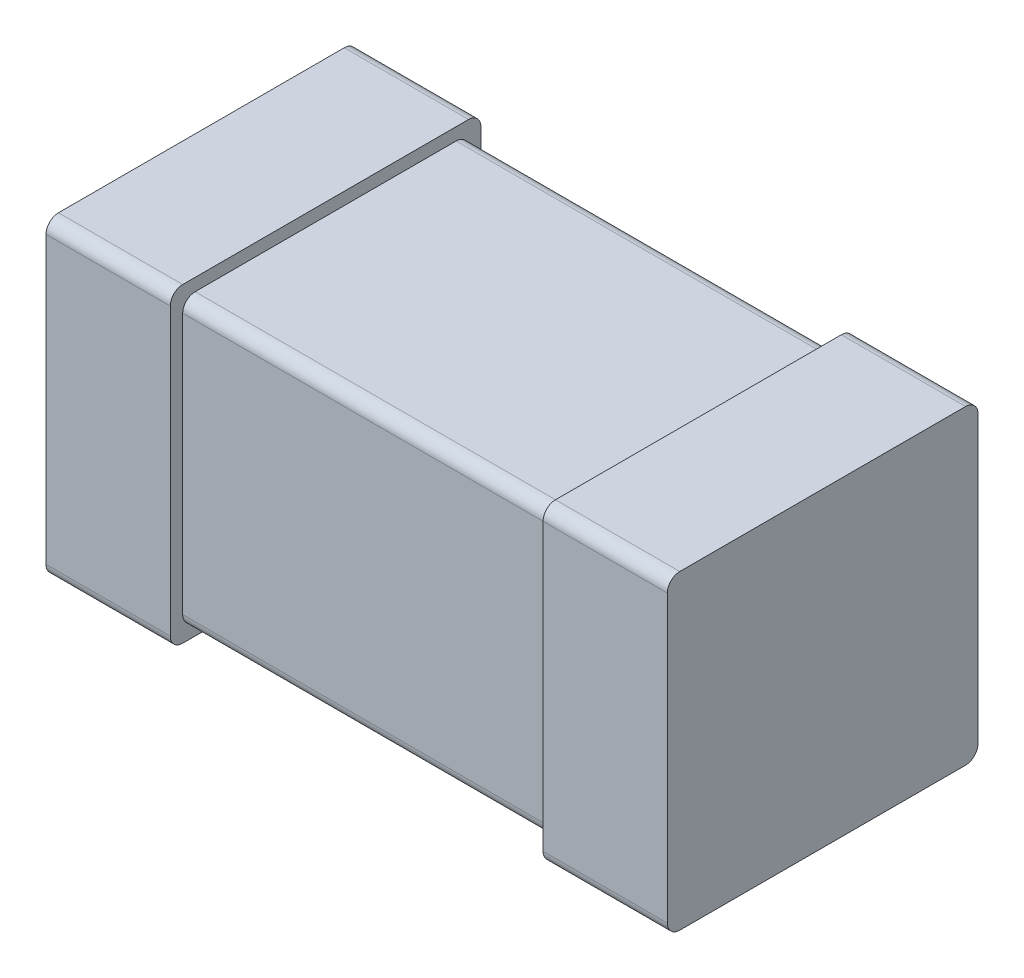
ISO-10303-21;
HEADER;
FILE_DESCRIPTION(('STEP AP214'),'2;1');
FILE_NAME('part.step','',(''),(''),'','','');
FILE_SCHEMA(('AUTOMOTIVE_DESIGN { 1 0 10303 214 1 1 1 1 }'));
ENDSEC;
DATA;
#1=APPLICATION_CONTEXT('core data for automotive mechanical design processes');
#2=APPLICATION_PROTOCOL_DEFINITION('international standard','automotive_design',2000,#1);
#3=PRODUCT_CONTEXT('',#1,'mechanical');
#4=PRODUCT('Part','Part','',(#3));
#5=PRODUCT_RELATED_PRODUCT_CATEGORY('part','',(#4));
#6=PRODUCT_DEFINITION_FORMATION('','',#4);
#7=PRODUCT_DEFINITION_CONTEXT('part definition',#1,'design');
#8=PRODUCT_DEFINITION('design','',#6,#7);
#9=PRODUCT_DEFINITION_SHAPE('','',#8);
#10=(LENGTH_UNIT() NAMED_UNIT(*) SI_UNIT(.MILLI.,.METRE.));
#11=(NAMED_UNIT(*) PLANE_ANGLE_UNIT() SI_UNIT($,.RADIAN.));
#12=(NAMED_UNIT(*) SI_UNIT($,.STERADIAN.) SOLID_ANGLE_UNIT());
#13=UNCERTAINTY_MEASURE_WITH_UNIT(LENGTH_MEASURE(1.E-05),#10,'distance_accuracy_value','');
#14=(GEOMETRIC_REPRESENTATION_CONTEXT(3) GLOBAL_UNCERTAINTY_ASSIGNED_CONTEXT((#13)) GLOBAL_UNIT_ASSIGNED_CONTEXT((#10,
#11,#12)) REPRESENTATION_CONTEXT('',''));
#15=CARTESIAN_POINT('',(0.,0.,0.));
#16=DIRECTION('',(0.,0.,1.));
#17=DIRECTION('',(1.,0.,0.));
#18=AXIS2_PLACEMENT_3D('',#15,#16,#17);
#19=CARTESIAN_POINT('',(0.5,-0.25,0.));
#20=DIRECTION('',(1.,0.,0.));
#21=DIRECTION('',(0.,1.,0.));
#22=AXIS2_PLACEMENT_3D('',#19,#20,#21);
#23=PLANE('',#22);
#24=DIRECTION('',(0.,0.,1.));
#25=VECTOR('',#24,1.);
#26=CARTESIAN_POINT('',(0.5,-0.25,0.));
#27=LINE('',#26,#25);
#28=CARTESIAN_POINT('',(0.5,-0.25,0.02));
#29=VERTEX_POINT('',#28);
#30=CARTESIAN_POINT('',(0.5,-0.25,0.48));
#31=VERTEX_POINT('',#30);
#32=EDGE_CURVE('E269',#29,#31,#27,.T.);
#33=ORIENTED_EDGE('',*,*,#32,.F.);
#34=CARTESIAN_POINT('',(0.5,-0.23,0.02));
#35=DIRECTION('',(1.,0.,0.));
#36=DIRECTION('',(0.,0.,1.));
#37=AXIS2_PLACEMENT_3D('',#34,#35,#36);
#38=CIRCLE('',#37,0.02);
#39=CARTESIAN_POINT('',(0.5,-0.23,0.));
#40=VERTEX_POINT('',#39);
#41=EDGE_CURVE('E346',#29,#40,#38,.T.);
#42=ORIENTED_EDGE('',*,*,#41,.T.);
#43=DIRECTION('',(0.,1.,0.));
#44=VECTOR('',#43,1.);
#45=CARTESIAN_POINT('',(0.5,-0.25,0.));
#46=LINE('',#45,#44);
#47=CARTESIAN_POINT('',(0.5,0.23,0.));
#48=VERTEX_POINT('',#47);
#49=EDGE_CURVE('E263',#40,#48,#46,.T.);
#50=ORIENTED_EDGE('',*,*,#49,.T.);
#51=CARTESIAN_POINT('',(0.5,0.23,0.02));
#52=DIRECTION('',(-1.,0.,0.));
#53=DIRECTION('',(0.,0.,1.));
#54=AXIS2_PLACEMENT_3D('',#51,#52,#53);
#55=CIRCLE('',#54,0.02);
#56=CARTESIAN_POINT('',(0.5,0.25,0.02));
#57=VERTEX_POINT('',#56);
#58=EDGE_CURVE('E295',#57,#48,#55,.T.);
#59=ORIENTED_EDGE('',*,*,#58,.F.);
#60=DIRECTION('',(0.,0.,1.));
#61=VECTOR('',#60,1.);
#62=CARTESIAN_POINT('',(0.5,0.25,0.));
#63=LINE('',#62,#61);
#64=CARTESIAN_POINT('',(0.5,0.25,0.48));
#65=VERTEX_POINT('',#64);
#66=EDGE_CURVE('E11',#57,#65,#63,.T.);
#67=ORIENTED_EDGE('',*,*,#66,.T.);
#68=CARTESIAN_POINT('',(0.5,0.23,0.48));
#69=DIRECTION('',(1.,0.,0.));
#70=DIRECTION('',(0.,0.,1.));
#71=AXIS2_PLACEMENT_3D('',#68,#69,#70);
#72=CIRCLE('',#71,0.02);
#73=CARTESIAN_POINT('',(0.5,0.23,0.5));
#74=VERTEX_POINT('',#73);
#75=EDGE_CURVE('E214',#65,#74,#72,.T.);
#76=ORIENTED_EDGE('',*,*,#75,.T.);
#77=DIRECTION('',(0.,1.,0.));
#78=VECTOR('',#77,1.);
#79=CARTESIAN_POINT('',(0.5,-0.25,0.5));
#80=LINE('',#79,#78);
#81=CARTESIAN_POINT('',(0.5,-0.23,0.5));
#82=VERTEX_POINT('',#81);
#83=EDGE_CURVE('E259',#82,#74,#80,.T.);
#84=ORIENTED_EDGE('',*,*,#83,.F.);
#85=CARTESIAN_POINT('',(0.5,-0.23,0.48));
#86=DIRECTION('',(-1.,0.,0.));
#87=DIRECTION('',(0.,0.,1.));
#88=AXIS2_PLACEMENT_3D('',#85,#86,#87);
#89=CIRCLE('',#88,0.02);
#90=EDGE_CURVE('E333',#31,#82,#89,.T.);
#91=ORIENTED_EDGE('',*,*,#90,.F.);
#92=EDGE_LOOP('',(#33,#42,#50,#59,#67,#76,#84,#91));
#93=FACE_BOUND('',#92,.T.);
#94=ADVANCED_FACE('F16',(#93),#23,.T.);
#95=CARTESIAN_POINT('',(0.3,0.25,0.));
#96=DIRECTION('',(0.,1.,0.));
#97=DIRECTION('',(1.,0.,0.));
#98=AXIS2_PLACEMENT_3D('',#95,#96,#97);
#99=PLANE('',#98);
#100=ORIENTED_EDGE('',*,*,#66,.F.);
#101=DIRECTION('',(1.,0.,0.));
#102=VECTOR('',#101,1.);
#103=CARTESIAN_POINT('',(0.3,0.25,0.02));
#104=LINE('',#103,#102);
#105=CARTESIAN_POINT('',(0.3,0.25,0.02));
#106=VERTEX_POINT('',#105);
#107=EDGE_CURVE('E222',#106,#57,#104,.T.);
#108=ORIENTED_EDGE('',*,*,#107,.F.);
#109=DIRECTION('',(0.,0.,1.));
#110=VECTOR('',#109,1.);
#111=CARTESIAN_POINT('',(0.3,0.25,0.));
#112=LINE('',#111,#110);
#113=CARTESIAN_POINT('',(0.3,0.25,0.48));
#114=VERTEX_POINT('',#113);
#115=EDGE_CURVE('E219',#106,#114,#112,.T.);
#116=ORIENTED_EDGE('',*,*,#115,.T.);
#117=DIRECTION('',(1.,0.,0.));
#118=VECTOR('',#117,1.);
#119=CARTESIAN_POINT('',(0.3,0.25,0.48));
#120=LINE('',#119,#118);
#121=EDGE_CURVE('E27',#114,#65,#120,.T.);
#122=ORIENTED_EDGE('',*,*,#121,.T.);
#123=EDGE_LOOP('',(#100,#108,#116,#122));
#124=FACE_BOUND('',#123,.T.);
#125=ADVANCED_FACE('F220',(#124),#99,.T.);
#126=CARTESIAN_POINT('',(0.3,0.23,0.48));
#127=DIRECTION('',(1.,0.,0.));
#128=DIRECTION('',(0.,1.,0.));
#129=AXIS2_PLACEMENT_3D('',#126,#127,#128);
#130=CYLINDRICAL_SURFACE('',#129,0.02);
#131=CARTESIAN_POINT('',(0.3,0.23,0.48));
#132=DIRECTION('',(1.,0.,0.));
#133=DIRECTION('',(0.,0.,1.));
#134=AXIS2_PLACEMENT_3D('',#131,#132,#133);
#135=CIRCLE('',#134,0.02);
#136=CARTESIAN_POINT('',(0.3,0.23,0.5));
#137=VERTEX_POINT('',#136);
#138=EDGE_CURVE('E212',#114,#137,#135,.T.);
#139=ORIENTED_EDGE('',*,*,#138,.T.);
#140=DIRECTION('',(1.,0.,0.));
#141=VECTOR('',#140,1.);
#142=CARTESIAN_POINT('',(0.3,0.23,0.5));
#143=LINE('',#142,#141);
#144=EDGE_CURVE('E262',#137,#74,#143,.T.);
#145=ORIENTED_EDGE('',*,*,#144,.T.);
#146=ORIENTED_EDGE('',*,*,#75,.F.);
#147=ORIENTED_EDGE('',*,*,#121,.F.);
#148=EDGE_LOOP('',(#139,#145,#146,#147));
#149=FACE_BOUND('',#148,.T.);
#150=ADVANCED_FACE('F209',(#149),#130,.T.);
#151=CARTESIAN_POINT('',(0.3,0.23,0.02));
#152=DIRECTION('',(1.,0.,0.));
#153=DIRECTION('',(0.,1.,0.));
#154=AXIS2_PLACEMENT_3D('',#151,#152,#153);
#155=CYLINDRICAL_SURFACE('',#154,0.02);
#156=ORIENTED_EDGE('',*,*,#107,.T.);
#157=ORIENTED_EDGE('',*,*,#58,.T.);
#158=DIRECTION('',(1.,0.,0.));
#159=VECTOR('',#158,1.);
#160=CARTESIAN_POINT('',(0.3,0.23,0.));
#161=LINE('',#160,#159);
#162=CARTESIAN_POINT('',(0.3,0.23,0.));
#163=VERTEX_POINT('',#162);
#164=EDGE_CURVE('E313',#163,#48,#161,.T.);
#165=ORIENTED_EDGE('',*,*,#164,.F.);
#166=CARTESIAN_POINT('',(0.3,0.23,0.02));
#167=DIRECTION('',(-1.,0.,0.));
#168=DIRECTION('',(0.,0.,1.));
#169=AXIS2_PLACEMENT_3D('',#166,#167,#168);
#170=CIRCLE('',#169,0.02);
#171=EDGE_CURVE('E227',#106,#163,#170,.T.);
#172=ORIENTED_EDGE('',*,*,#171,.F.);
#173=EDGE_LOOP('',(#156,#157,#165,#172));
#174=FACE_BOUND('',#173,.T.);
#175=ADVANCED_FACE('F644',(#174),#155,.T.);
#176=CARTESIAN_POINT('',(0.3,-0.25,0.5));
#177=DIRECTION('',(0.,0.,1.));
#178=DIRECTION('',(1.,0.,0.));
#179=AXIS2_PLACEMENT_3D('',#176,#177,#178);
#180=PLANE('',#179);
#181=DIRECTION('',(0.,1.,0.));
#182=VECTOR('',#181,1.);
#183=CARTESIAN_POINT('',(0.3,-0.25,0.5));
#184=LINE('',#183,#182);
#185=CARTESIAN_POINT('',(0.3,-0.23,0.5));
#186=VERTEX_POINT('',#185);
#187=EDGE_CURVE('E232',#186,#137,#184,.T.);
#188=ORIENTED_EDGE('',*,*,#187,.F.);
#189=DIRECTION('',(1.,0.,0.));
#190=VECTOR('',#189,1.);
#191=CARTESIAN_POINT('',(0.3,-0.23,0.5));
#192=LINE('',#191,#190);
#193=EDGE_CURVE('E329',#186,#82,#192,.T.);
#194=ORIENTED_EDGE('',*,*,#193,.T.);
#195=ORIENTED_EDGE('',*,*,#83,.T.);
#196=ORIENTED_EDGE('',*,*,#144,.F.);
#197=EDGE_LOOP('',(#188,#194,#195,#196));
#198=FACE_BOUND('',#197,.T.);
#199=ADVANCED_FACE('F491',(#198),#180,.T.);
#200=CARTESIAN_POINT('',(0.3,-0.25,0.));
#201=DIRECTION('',(0.,0.,1.));
#202=DIRECTION('',(1.,0.,0.));
#203=AXIS2_PLACEMENT_3D('',#200,#201,#202);
#204=PLANE('',#203);
#205=ORIENTED_EDGE('',*,*,#164,.T.);
#206=ORIENTED_EDGE('',*,*,#49,.F.);
#207=DIRECTION('',(1.,0.,0.));
#208=VECTOR('',#207,1.);
#209=CARTESIAN_POINT('',(0.3,-0.23,0.));
#210=LINE('',#209,#208);
#211=CARTESIAN_POINT('',(0.3,-0.23,0.));
#212=VERTEX_POINT('',#211);
#213=EDGE_CURVE('E243',#212,#40,#210,.T.);
#214=ORIENTED_EDGE('',*,*,#213,.F.);
#215=DIRECTION('',(0.,1.,0.));
#216=VECTOR('',#215,1.);
#217=CARTESIAN_POINT('',(0.3,-0.25,0.));
#218=LINE('',#217,#216);
#219=EDGE_CURVE('E368',#212,#163,#218,.T.);
#220=ORIENTED_EDGE('',*,*,#219,.T.);
#221=EDGE_LOOP('',(#205,#206,#214,#220));
#222=FACE_BOUND('',#221,.T.);
#223=ADVANCED_FACE('F704',(#222),#204,.F.);
#224=CARTESIAN_POINT('',(0.3,-0.23,0.48));
#225=DIRECTION('',(1.,0.,0.));
#226=DIRECTION('',(0.,-1.,0.));
#227=AXIS2_PLACEMENT_3D('',#224,#225,#226);
#228=CYLINDRICAL_SURFACE('',#227,0.02);
#229=DIRECTION('',(1.,0.,0.));
#230=VECTOR('',#229,1.);
#231=CARTESIAN_POINT('',(0.3,-0.25,0.48));
#232=LINE('',#231,#230);
#233=CARTESIAN_POINT('',(0.3,-0.25,0.48));
#234=VERTEX_POINT('',#233);
#235=EDGE_CURVE('E270',#234,#31,#232,.T.);
#236=ORIENTED_EDGE('',*,*,#235,.T.);
#237=ORIENTED_EDGE('',*,*,#90,.T.);
#238=ORIENTED_EDGE('',*,*,#193,.F.);
#239=CARTESIAN_POINT('',(0.3,-0.23,0.48));
#240=DIRECTION('',(-1.,0.,0.));
#241=DIRECTION('',(0.,0.,1.));
#242=AXIS2_PLACEMENT_3D('',#239,#240,#241);
#243=CIRCLE('',#242,0.02);
#244=EDGE_CURVE('E239',#234,#186,#243,.T.);
#245=ORIENTED_EDGE('',*,*,#244,.F.);
#246=EDGE_LOOP('',(#236,#237,#238,#245));
#247=FACE_BOUND('',#246,.T.);
#248=ADVANCED_FACE('F489',(#247),#228,.T.);
#249=CARTESIAN_POINT('',(0.3,-0.23,0.02));
#250=DIRECTION('',(1.,0.,0.));
#251=DIRECTION('',(0.,-1.,0.));
#252=AXIS2_PLACEMENT_3D('',#249,#250,#251);
#253=CYLINDRICAL_SURFACE('',#252,0.02);
#254=CARTESIAN_POINT('',(0.3,-0.23,0.02));
#255=DIRECTION('',(1.,0.,0.));
#256=DIRECTION('',(0.,0.,1.));
#257=AXIS2_PLACEMENT_3D('',#254,#255,#256);
#258=CIRCLE('',#257,0.02);
#259=CARTESIAN_POINT('',(0.3,-0.25,0.02));
#260=VERTEX_POINT('',#259);
#261=EDGE_CURVE('E446',#260,#212,#258,.T.);
#262=ORIENTED_EDGE('',*,*,#261,.T.);
#263=ORIENTED_EDGE('',*,*,#213,.T.);
#264=ORIENTED_EDGE('',*,*,#41,.F.);
#265=DIRECTION('',(1.,0.,0.));
#266=VECTOR('',#265,1.);
#267=CARTESIAN_POINT('',(0.3,-0.25,0.02));
#268=LINE('',#267,#266);
#269=EDGE_CURVE('E265',#260,#29,#268,.T.);
#270=ORIENTED_EDGE('',*,*,#269,.F.);
#271=EDGE_LOOP('',(#262,#263,#264,#270));
#272=FACE_BOUND('',#271,.T.);
#273=ADVANCED_FACE('F693',(#272),#253,.T.);
#274=CARTESIAN_POINT('',(0.3,-0.25,0.));
#275=DIRECTION('',(0.,1.,0.));
#276=DIRECTION('',(1.,0.,0.));
#277=AXIS2_PLACEMENT_3D('',#274,#275,#276);
#278=PLANE('',#277);
#279=ORIENTED_EDGE('',*,*,#235,.F.);
#280=DIRECTION('',(0.,0.,1.));
#281=VECTOR('',#280,1.);
#282=CARTESIAN_POINT('',(0.3,-0.25,0.));
#283=LINE('',#282,#281);
#284=EDGE_CURVE('E372',#260,#234,#283,.T.);
#285=ORIENTED_EDGE('',*,*,#284,.F.);
#286=ORIENTED_EDGE('',*,*,#269,.T.);
#287=ORIENTED_EDGE('',*,*,#32,.T.);
#288=EDGE_LOOP('',(#279,#285,#286,#287));
#289=FACE_BOUND('',#288,.T.);
#290=ADVANCED_FACE('F688',(#289),#278,.F.);
#291=CARTESIAN_POINT('',(0.3,-0.25,0.));
#292=DIRECTION('',(1.,0.,0.));
#293=DIRECTION('',(0.,1.,0.));
#294=AXIS2_PLACEMENT_3D('',#291,#292,#293);
#295=PLANE('',#294);
#296=DIRECTION('',(0.,1.,0.));
#297=VECTOR('',#296,1.);
#298=CARTESIAN_POINT('',(0.3,-0.23,0.02));
#299=LINE('',#298,#297);
#300=CARTESIAN_POINT('',(0.3,-0.21,0.02));
#301=VERTEX_POINT('',#300);
#302=CARTESIAN_POINT('',(0.3,0.21,0.02));
#303=VERTEX_POINT('',#302);
#304=EDGE_CURVE('E310',#301,#303,#299,.T.);
#305=ORIENTED_EDGE('',*,*,#304,.T.);
#306=CARTESIAN_POINT('',(0.3,0.21,0.04));
#307=DIRECTION('',(-1.,0.,0.));
#308=DIRECTION('',(0.,0.,1.));
#309=AXIS2_PLACEMENT_3D('',#306,#307,#308);
#310=CIRCLE('',#309,0.02);
#311=CARTESIAN_POINT('',(0.3,0.23,0.04));
#312=VERTEX_POINT('',#311);
#313=EDGE_CURVE('E309',#312,#303,#310,.T.);
#314=ORIENTED_EDGE('',*,*,#313,.F.);
#315=DIRECTION('',(0.,0.,1.));
#316=VECTOR('',#315,1.);
#317=CARTESIAN_POINT('',(0.3,0.23,0.02));
#318=LINE('',#317,#316);
#319=CARTESIAN_POINT('',(0.3,0.23,0.46));
#320=VERTEX_POINT('',#319);
#321=EDGE_CURVE('E432',#312,#320,#318,.T.);
#322=ORIENTED_EDGE('',*,*,#321,.T.);
#323=CARTESIAN_POINT('',(0.3,0.21,0.46));
#324=DIRECTION('',(1.,0.,0.));
#325=DIRECTION('',(0.,0.,1.));
#326=AXIS2_PLACEMENT_3D('',#323,#324,#325);
#327=CIRCLE('',#326,0.02);
#328=CARTESIAN_POINT('',(0.3,0.21,0.48));
#329=VERTEX_POINT('',#328);
#330=EDGE_CURVE('E339',#320,#329,#327,.T.);
#331=ORIENTED_EDGE('',*,*,#330,.T.);
#332=DIRECTION('',(0.,1.,0.));
#333=VECTOR('',#332,1.);
#334=CARTESIAN_POINT('',(0.3,-0.23,0.48));
#335=LINE('',#334,#333);
#336=CARTESIAN_POINT('',(0.3,-0.21,0.48));
#337=VERTEX_POINT('',#336);
#338=EDGE_CURVE('E338',#337,#329,#335,.T.);
#339=ORIENTED_EDGE('',*,*,#338,.F.);
#340=CARTESIAN_POINT('',(0.3,-0.21,0.46));
#341=DIRECTION('',(-1.,0.,0.));
#342=DIRECTION('',(0.,0.,1.));
#343=AXIS2_PLACEMENT_3D('',#340,#341,#342);
#344=CIRCLE('',#343,0.02);
#345=CARTESIAN_POINT('',(0.3,-0.23,0.46));
#346=VERTEX_POINT('',#345);
#347=EDGE_CURVE('E324',#346,#337,#344,.T.);
#348=ORIENTED_EDGE('',*,*,#347,.F.);
#349=DIRECTION('',(0.,0.,1.));
#350=VECTOR('',#349,1.);
#351=CARTESIAN_POINT('',(0.3,-0.23,0.02));
#352=LINE('',#351,#350);
#353=CARTESIAN_POINT('',(0.3,-0.23,0.04));
#354=VERTEX_POINT('',#353);
#355=EDGE_CURVE('E327',#354,#346,#352,.T.);
#356=ORIENTED_EDGE('',*,*,#355,.F.);
#357=CARTESIAN_POINT('',(0.3,-0.21,0.04));
#358=DIRECTION('',(1.,0.,0.));
#359=DIRECTION('',(0.,0.,1.));
#360=AXIS2_PLACEMENT_3D('',#357,#358,#359);
#361=CIRCLE('',#360,0.02);
#362=EDGE_CURVE('E303',#354,#301,#361,.T.);
#363=ORIENTED_EDGE('',*,*,#362,.T.);
#364=EDGE_LOOP('',(#305,#314,#322,#331,#339,#348,#356,#363));
#365=FACE_BOUND('',#364,.T.);
#366=ORIENTED_EDGE('',*,*,#244,.T.);
#367=ORIENTED_EDGE('',*,*,#187,.T.);
#368=ORIENTED_EDGE('',*,*,#138,.F.);
#369=ORIENTED_EDGE('',*,*,#115,.F.);
#370=ORIENTED_EDGE('',*,*,#171,.T.);
#371=ORIENTED_EDGE('',*,*,#219,.F.);
#372=ORIENTED_EDGE('',*,*,#261,.F.);
#373=ORIENTED_EDGE('',*,*,#284,.T.);
#374=EDGE_LOOP('',(#366,#367,#368,#369,#370,#371,#372,#373));
#375=FACE_BOUND('',#374,.T.);
#376=ADVANCED_FACE('F230',(#365,#375),#295,.F.);
#377=CARTESIAN_POINT('',(-0.3,-0.23,0.02));
#378=DIRECTION('',(0.,1.,0.));
#379=DIRECTION('',(1.,0.,0.));
#380=AXIS2_PLACEMENT_3D('',#377,#378,#379);
#381=PLANE('',#380);
#382=DIRECTION('',(1.,0.,0.));
#383=VECTOR('',#382,1.);
#384=CARTESIAN_POINT('',(-0.3,-0.23,0.46));
#385=LINE('',#384,#383);
#386=CARTESIAN_POINT('',(-0.3,-0.23,0.46));
#387=VERTEX_POINT('',#386);
#388=EDGE_CURVE('E328',#387,#346,#385,.T.);
#389=ORIENTED_EDGE('',*,*,#388,.F.);
#390=DIRECTION('',(0.,0.,1.));
#391=VECTOR('',#390,1.);
#392=CARTESIAN_POINT('',(-0.3,-0.23,0.02));
#393=LINE('',#392,#391);
#394=CARTESIAN_POINT('',(-0.3,-0.23,0.04));
#395=VERTEX_POINT('',#394);
#396=EDGE_CURVE('E257',#395,#387,#393,.T.);
#397=ORIENTED_EDGE('',*,*,#396,.F.);
#398=DIRECTION('',(1.,0.,0.));
#399=VECTOR('',#398,1.);
#400=CARTESIAN_POINT('',(-0.3,-0.23,0.04));
#401=LINE('',#400,#399);
#402=EDGE_CURVE('E408',#395,#354,#401,.T.);
#403=ORIENTED_EDGE('',*,*,#402,.T.);
#404=ORIENTED_EDGE('',*,*,#355,.T.);
#405=EDGE_LOOP('',(#389,#397,#403,#404));
#406=FACE_BOUND('',#405,.T.);
#407=ADVANCED_FACE('F18',(#406),#381,.F.);
#408=CARTESIAN_POINT('',(-0.3,-0.21,0.46));
#409=DIRECTION('',(1.,0.,0.));
#410=DIRECTION('',(0.,-1.,0.));
#411=AXIS2_PLACEMENT_3D('',#408,#409,#410);
#412=CYLINDRICAL_SURFACE('',#411,0.02);
#413=ORIENTED_EDGE('',*,*,#388,.T.);
#414=ORIENTED_EDGE('',*,*,#347,.T.);
#415=DIRECTION('',(1.,0.,0.));
#416=VECTOR('',#415,1.);
#417=CARTESIAN_POINT('',(-0.3,-0.21,0.48));
#418=LINE('',#417,#416);
#419=CARTESIAN_POINT('',(-0.3,-0.21,0.48));
#420=VERTEX_POINT('',#419);
#421=EDGE_CURVE('E334',#420,#337,#418,.T.);
#422=ORIENTED_EDGE('',*,*,#421,.F.);
#423=CARTESIAN_POINT('',(-0.3,-0.21,0.46));
#424=DIRECTION('',(-1.,0.,0.));
#425=DIRECTION('',(0.,0.,1.));
#426=AXIS2_PLACEMENT_3D('',#423,#424,#425);
#427=CIRCLE('',#426,0.02);
#428=EDGE_CURVE('E351',#387,#420,#427,.T.);
#429=ORIENTED_EDGE('',*,*,#428,.F.);
#430=EDGE_LOOP('',(#413,#414,#422,#429));
#431=FACE_BOUND('',#430,.T.);
#432=ADVANCED_FACE('F534',(#431),#412,.T.);
#433=CARTESIAN_POINT('',(-0.3,-0.23,0.48));
#434=DIRECTION('',(0.,0.,1.));
#435=DIRECTION('',(1.,0.,0.));
#436=AXIS2_PLACEMENT_3D('',#433,#434,#435);
#437=PLANE('',#436);
#438=DIRECTION('',(0.,1.,0.));
#439=VECTOR('',#438,1.);
#440=CARTESIAN_POINT('',(-0.3,-0.23,0.48));
#441=LINE('',#440,#439);
#442=CARTESIAN_POINT('',(-0.3,0.21,0.48));
#443=VERTEX_POINT('',#442);
#444=EDGE_CURVE('E347',#420,#443,#441,.T.);
#445=ORIENTED_EDGE('',*,*,#444,.F.);
#446=ORIENTED_EDGE('',*,*,#421,.T.);
#447=ORIENTED_EDGE('',*,*,#338,.T.);
#448=DIRECTION('',(1.,0.,0.));
#449=VECTOR('',#448,1.);
#450=CARTESIAN_POINT('',(-0.3,0.21,0.48));
#451=LINE('',#450,#449);
#452=EDGE_CURVE('E365',#443,#329,#451,.T.);
#453=ORIENTED_EDGE('',*,*,#452,.F.);
#454=EDGE_LOOP('',(#445,#446,#447,#453));
#455=FACE_BOUND('',#454,.T.);
#456=ADVANCED_FACE('F538',(#455),#437,.T.);
#457=CARTESIAN_POINT('',(-0.3,0.21,0.46));
#458=DIRECTION('',(1.,0.,0.));
#459=DIRECTION('',(0.,1.,0.));
#460=AXIS2_PLACEMENT_3D('',#457,#458,#459);
#461=CYLINDRICAL_SURFACE('',#460,0.02);
#462=CARTESIAN_POINT('',(-0.3,0.21,0.46));
#463=DIRECTION('',(1.,0.,0.));
#464=DIRECTION('',(0.,0.,1.));
#465=AXIS2_PLACEMENT_3D('',#462,#463,#464);
#466=CIRCLE('',#465,0.02);
#467=CARTESIAN_POINT('',(-0.3,0.23,0.46));
#468=VERTEX_POINT('',#467);
#469=EDGE_CURVE('E323',#468,#443,#466,.T.);
#470=ORIENTED_EDGE('',*,*,#469,.T.);
#471=ORIENTED_EDGE('',*,*,#452,.T.);
#472=ORIENTED_EDGE('',*,*,#330,.F.);
#473=DIRECTION('',(1.,0.,0.));
#474=VECTOR('',#473,1.);
#475=CARTESIAN_POINT('',(-0.3,0.23,0.46));
#476=LINE('',#475,#474);
#477=EDGE_CURVE('E393',#468,#320,#476,.T.);
#478=ORIENTED_EDGE('',*,*,#477,.F.);
#479=EDGE_LOOP('',(#470,#471,#472,#478));
#480=FACE_BOUND('',#479,.T.);
#481=ADVANCED_FACE('F550',(#480),#461,.T.);
#482=CARTESIAN_POINT('',(-0.3,0.23,0.02));
#483=DIRECTION('',(0.,1.,0.));
#484=DIRECTION('',(1.,0.,0.));
#485=AXIS2_PLACEMENT_3D('',#482,#483,#484);
#486=PLANE('',#485);
#487=ORIENTED_EDGE('',*,*,#321,.F.);
#488=DIRECTION('',(1.,0.,0.));
#489=VECTOR('',#488,1.);
#490=CARTESIAN_POINT('',(-0.3,0.23,0.04));
#491=LINE('',#490,#489);
#492=CARTESIAN_POINT('',(-0.3,0.23,0.04));
#493=VERTEX_POINT('',#492);
#494=EDGE_CURVE('E305',#493,#312,#491,.T.);
#495=ORIENTED_EDGE('',*,*,#494,.F.);
#496=DIRECTION('',(0.,0.,1.));
#497=VECTOR('',#496,1.);
#498=CARTESIAN_POINT('',(-0.3,0.23,0.02));
#499=LINE('',#498,#497);
#500=EDGE_CURVE('E319',#493,#468,#499,.T.);
#501=ORIENTED_EDGE('',*,*,#500,.T.);
#502=ORIENTED_EDGE('',*,*,#477,.T.);
#503=EDGE_LOOP('',(#487,#495,#501,#502));
#504=FACE_BOUND('',#503,.T.);
#505=ADVANCED_FACE('F555',(#504),#486,.T.);
#506=CARTESIAN_POINT('',(-0.3,0.21,0.04));
#507=DIRECTION('',(1.,0.,0.));
#508=DIRECTION('',(0.,1.,0.));
#509=AXIS2_PLACEMENT_3D('',#506,#507,#508);
#510=CYLINDRICAL_SURFACE('',#509,0.02);
#511=ORIENTED_EDGE('',*,*,#494,.T.);
#512=ORIENTED_EDGE('',*,*,#313,.T.);
#513=DIRECTION('',(1.,0.,0.));
#514=VECTOR('',#513,1.);
#515=CARTESIAN_POINT('',(-0.3,0.21,0.02));
#516=LINE('',#515,#514);
#517=CARTESIAN_POINT('',(-0.3,0.21,0.02));
#518=VERTEX_POINT('',#517);
#519=EDGE_CURVE('E439',#518,#303,#516,.T.);
#520=ORIENTED_EDGE('',*,*,#519,.F.);
#521=CARTESIAN_POINT('',(-0.3,0.21,0.04));
#522=DIRECTION('',(-1.,0.,0.));
#523=DIRECTION('',(0.,0.,1.));
#524=AXIS2_PLACEMENT_3D('',#521,#522,#523);
#525=CIRCLE('',#524,0.02);
#526=EDGE_CURVE('E318',#493,#518,#525,.T.);
#527=ORIENTED_EDGE('',*,*,#526,.F.);
#528=EDGE_LOOP('',(#511,#512,#520,#527));
#529=FACE_BOUND('',#528,.T.);
#530=ADVANCED_FACE('F558',(#529),#510,.T.);
#531=CARTESIAN_POINT('',(-0.3,-0.23,0.02));
#532=DIRECTION('',(0.,0.,1.));
#533=DIRECTION('',(1.,0.,0.));
#534=AXIS2_PLACEMENT_3D('',#531,#532,#533);
#535=PLANE('',#534);
#536=ORIENTED_EDGE('',*,*,#519,.T.);
#537=ORIENTED_EDGE('',*,*,#304,.F.);
#538=DIRECTION('',(1.,0.,0.));
#539=VECTOR('',#538,1.);
#540=CARTESIAN_POINT('',(-0.3,-0.21,0.02));
#541=LINE('',#540,#539);
#542=CARTESIAN_POINT('',(-0.3,-0.21,0.02));
#543=VERTEX_POINT('',#542);
#544=EDGE_CURVE('E299',#543,#301,#541,.T.);
#545=ORIENTED_EDGE('',*,*,#544,.F.);
#546=DIRECTION('',(0.,1.,0.));
#547=VECTOR('',#546,1.);
#548=CARTESIAN_POINT('',(-0.3,-0.23,0.02));
#549=LINE('',#548,#547);
#550=EDGE_CURVE('E304',#543,#518,#549,.T.);
#551=ORIENTED_EDGE('',*,*,#550,.T.);
#552=EDGE_LOOP('',(#536,#537,#545,#551));
#553=FACE_BOUND('',#552,.T.);
#554=ADVANCED_FACE('F561',(#553),#535,.F.);
#555=CARTESIAN_POINT('',(-0.3,-0.21,0.04));
#556=DIRECTION('',(1.,0.,0.));
#557=DIRECTION('',(0.,-1.,0.));
#558=AXIS2_PLACEMENT_3D('',#555,#556,#557);
#559=CYLINDRICAL_SURFACE('',#558,0.02);
#560=CARTESIAN_POINT('',(-0.3,-0.21,0.04));
#561=DIRECTION('',(1.,0.,0.));
#562=DIRECTION('',(0.,0.,1.));
#563=AXIS2_PLACEMENT_3D('',#560,#561,#562);
#564=CIRCLE('',#563,0.02);
#565=EDGE_CURVE('E253',#395,#543,#564,.T.);
#566=ORIENTED_EDGE('',*,*,#565,.T.);
#567=ORIENTED_EDGE('',*,*,#544,.T.);
#568=ORIENTED_EDGE('',*,*,#362,.F.);
#569=ORIENTED_EDGE('',*,*,#402,.F.);
#570=EDGE_LOOP('',(#566,#567,#568,#569));
#571=FACE_BOUND('',#570,.T.);
#572=ADVANCED_FACE('F563',(#571),#559,.T.);
#573=CARTESIAN_POINT('',(-0.3,-0.25,0.));
#574=DIRECTION('',(1.,0.,0.));
#575=DIRECTION('',(0.,1.,0.));
#576=AXIS2_PLACEMENT_3D('',#573,#574,#575);
#577=PLANE('',#576);
#578=ORIENTED_EDGE('',*,*,#565,.F.);
#579=ORIENTED_EDGE('',*,*,#396,.T.);
#580=ORIENTED_EDGE('',*,*,#428,.T.);
#581=ORIENTED_EDGE('',*,*,#444,.T.);
#582=ORIENTED_EDGE('',*,*,#469,.F.);
#583=ORIENTED_EDGE('',*,*,#500,.F.);
#584=ORIENTED_EDGE('',*,*,#526,.T.);
#585=ORIENTED_EDGE('',*,*,#550,.F.);
#586=EDGE_LOOP('',(#578,#579,#580,#581,#582,#583,#584,#585));
#587=FACE_BOUND('',#586,.T.);
#588=DIRECTION('',(0.,0.,1.));
#589=VECTOR('',#588,1.);
#590=CARTESIAN_POINT('',(-0.3,-0.25,0.));
#591=LINE('',#590,#589);
#592=CARTESIAN_POINT('',(-0.3,-0.25,0.02));
#593=VERTEX_POINT('',#592);
#594=CARTESIAN_POINT('',(-0.3,-0.25,0.48));
#595=VERTEX_POINT('',#594);
#596=EDGE_CURVE('E279',#593,#595,#591,.T.);
#597=ORIENTED_EDGE('',*,*,#596,.F.);
#598=CARTESIAN_POINT('',(-0.3,-0.23,0.02));
#599=DIRECTION('',(1.,0.,0.));
#600=DIRECTION('',(0.,0.,1.));
#601=AXIS2_PLACEMENT_3D('',#598,#599,#600);
#602=CIRCLE('',#601,0.02);
#603=CARTESIAN_POINT('',(-0.3,-0.23,0.));
#604=VERTEX_POINT('',#603);
#605=EDGE_CURVE('E247',#593,#604,#602,.T.);
#606=ORIENTED_EDGE('',*,*,#605,.T.);
#607=DIRECTION('',(0.,1.,0.));
#608=VECTOR('',#607,1.);
#609=CARTESIAN_POINT('',(-0.3,-0.25,0.));
#610=LINE('',#609,#608);
#611=CARTESIAN_POINT('',(-0.3,0.23,0.));
#612=VERTEX_POINT('',#611);
#613=EDGE_CURVE('E273',#604,#612,#610,.T.);
#614=ORIENTED_EDGE('',*,*,#613,.T.);
#615=CARTESIAN_POINT('',(-0.3,0.23,0.02));
#616=DIRECTION('',(-1.,0.,0.));
#617=DIRECTION('',(0.,0.,1.));
#618=AXIS2_PLACEMENT_3D('',#615,#616,#617);
#619=CIRCLE('',#618,0.02);
#620=CARTESIAN_POINT('',(-0.3,0.25,0.02));
#621=VERTEX_POINT('',#620);
#622=EDGE_CURVE('E418',#621,#612,#619,.T.);
#623=ORIENTED_EDGE('',*,*,#622,.F.);
#624=DIRECTION('',(0.,0.,1.));
#625=VECTOR('',#624,1.);
#626=CARTESIAN_POINT('',(-0.3,0.25,0.));
#627=LINE('',#626,#625);
#628=CARTESIAN_POINT('',(-0.3,0.25,0.48));
#629=VERTEX_POINT('',#628);
#630=EDGE_CURVE('E258',#621,#629,#627,.T.);
#631=ORIENTED_EDGE('',*,*,#630,.T.);
#632=CARTESIAN_POINT('',(-0.3,0.23,0.48));
#633=DIRECTION('',(1.,0.,0.));
#634=DIRECTION('',(0.,0.,1.));
#635=AXIS2_PLACEMENT_3D('',#632,#633,#634);
#636=CIRCLE('',#635,0.02);
#637=CARTESIAN_POINT('',(-0.3,0.23,0.5));
#638=VERTEX_POINT('',#637);
#639=EDGE_CURVE('E415',#629,#638,#636,.T.);
#640=ORIENTED_EDGE('',*,*,#639,.T.);
#641=DIRECTION('',(0.,1.,0.));
#642=VECTOR('',#641,1.);
#643=CARTESIAN_POINT('',(-0.3,-0.25,0.5));
#644=LINE('',#643,#642);
#645=CARTESIAN_POINT('',(-0.3,-0.23,0.5));
#646=VERTEX_POINT('',#645);
#647=EDGE_CURVE('E277',#646,#638,#644,.T.);
#648=ORIENTED_EDGE('',*,*,#647,.F.);
#649=CARTESIAN_POINT('',(-0.3,-0.23,0.48));
#650=DIRECTION('',(-1.,0.,0.));
#651=DIRECTION('',(0.,0.,1.));
#652=AXIS2_PLACEMENT_3D('',#649,#650,#651);
#653=CIRCLE('',#652,0.02);
#654=EDGE_CURVE('E251',#595,#646,#653,.T.);
#655=ORIENTED_EDGE('',*,*,#654,.F.);
#656=EDGE_LOOP('',(#597,#606,#614,#623,#631,#640,#648,#655));
#657=FACE_BOUND('',#656,.T.);
#658=ADVANCED_FACE('F507',(#587,#657),#577,.T.);
#659=CARTESIAN_POINT('',(-0.5,0.25,0.));
#660=DIRECTION('',(0.,1.,0.));
#661=DIRECTION('',(1.,0.,0.));
#662=AXIS2_PLACEMENT_3D('',#659,#660,#661);
#663=PLANE('',#662);
#664=ORIENTED_EDGE('',*,*,#630,.F.);
#665=DIRECTION('',(1.,0.,0.));
#666=VECTOR('',#665,1.);
#667=CARTESIAN_POINT('',(-0.5,0.25,0.02));
#668=LINE('',#667,#666);
#669=CARTESIAN_POINT('',(-0.5,0.25,0.02));
#670=VERTEX_POINT('',#669);
#671=EDGE_CURVE('E469',#670,#621,#668,.T.);
#672=ORIENTED_EDGE('',*,*,#671,.F.);
#673=DIRECTION('',(0.,0.,1.));
#674=VECTOR('',#673,1.);
#675=CARTESIAN_POINT('',(-0.5,0.25,0.));
#676=LINE('',#675,#674);
#677=CARTESIAN_POINT('',(-0.5,0.25,0.48));
#678=VERTEX_POINT('',#677);
#679=EDGE_CURVE('E287',#670,#678,#676,.T.);
#680=ORIENTED_EDGE('',*,*,#679,.T.);
#681=DIRECTION('',(1.,0.,0.));
#682=VECTOR('',#681,1.);
#683=CARTESIAN_POINT('',(-0.5,0.25,0.48));
#684=LINE('',#683,#682);
#685=EDGE_CURVE('E342',#678,#629,#684,.T.);
#686=ORIENTED_EDGE('',*,*,#685,.T.);
#687=EDGE_LOOP('',(#664,#672,#680,#686));
#688=FACE_BOUND('',#687,.T.);
#689=ADVANCED_FACE('F666',(#688),#663,.T.);
#690=CARTESIAN_POINT('',(-0.5,0.23,0.48));
#691=DIRECTION('',(1.,0.,0.));
#692=DIRECTION('',(0.,1.,0.));
#693=AXIS2_PLACEMENT_3D('',#690,#691,#692);
#694=CYLINDRICAL_SURFACE('',#693,0.02);
#695=CARTESIAN_POINT('',(-0.5,0.23,0.48));
#696=DIRECTION('',(1.,0.,0.));
#697=DIRECTION('',(0.,0.,1.));
#698=AXIS2_PLACEMENT_3D('',#695,#696,#697);
#699=CIRCLE('',#698,0.02);
#700=CARTESIAN_POINT('',(-0.5,0.23,0.5));
#701=VERTEX_POINT('',#700);
#702=EDGE_CURVE('E292',#678,#701,#699,.T.);
#703=ORIENTED_EDGE('',*,*,#702,.T.);
#704=DIRECTION('',(1.,0.,0.));
#705=VECTOR('',#704,1.);
#706=CARTESIAN_POINT('',(-0.5,0.23,0.5));
#707=LINE('',#706,#705);
#708=EDGE_CURVE('E425',#701,#638,#707,.T.);
#709=ORIENTED_EDGE('',*,*,#708,.T.);
#710=ORIENTED_EDGE('',*,*,#639,.F.);
#711=ORIENTED_EDGE('',*,*,#685,.F.);
#712=EDGE_LOOP('',(#703,#709,#710,#711));
#713=FACE_BOUND('',#712,.T.);
#714=ADVANCED_FACE('F661',(#713),#694,.T.);
#715=CARTESIAN_POINT('',(-0.5,0.23,0.02));
#716=DIRECTION('',(1.,0.,0.));
#717=DIRECTION('',(0.,1.,0.));
#718=AXIS2_PLACEMENT_3D('',#715,#716,#717);
#719=CYLINDRICAL_SURFACE('',#718,0.02);
#720=ORIENTED_EDGE('',*,*,#671,.T.);
#721=ORIENTED_EDGE('',*,*,#622,.T.);
#722=DIRECTION('',(1.,0.,0.));
#723=VECTOR('',#722,1.);
#724=CARTESIAN_POINT('',(-0.5,0.23,0.));
#725=LINE('',#724,#723);
#726=CARTESIAN_POINT('',(-0.5,0.23,0.));
#727=VERTEX_POINT('',#726);
#728=EDGE_CURVE('E278',#727,#612,#725,.T.);
#729=ORIENTED_EDGE('',*,*,#728,.F.);
#730=CARTESIAN_POINT('',(-0.5,0.23,0.02));
#731=DIRECTION('',(-1.,0.,0.));
#732=DIRECTION('',(0.,0.,1.));
#733=AXIS2_PLACEMENT_3D('',#730,#731,#732);
#734=CIRCLE('',#733,0.02);
#735=EDGE_CURVE('E291',#670,#727,#734,.T.);
#736=ORIENTED_EDGE('',*,*,#735,.F.);
#737=EDGE_LOOP('',(#720,#721,#729,#736));
#738=FACE_BOUND('',#737,.T.);
#739=ADVANCED_FACE('F501',(#738),#719,.T.);
#740=CARTESIAN_POINT('',(-0.5,-0.25,0.5));
#741=DIRECTION('',(0.,0.,1.));
#742=DIRECTION('',(1.,0.,0.));
#743=AXIS2_PLACEMENT_3D('',#740,#741,#742);
#744=PLANE('',#743);
#745=DIRECTION('',(0.,1.,0.));
#746=VECTOR('',#745,1.);
#747=CARTESIAN_POINT('',(-0.5,-0.25,0.5));
#748=LINE('',#747,#746);
#749=CARTESIAN_POINT('',(-0.5,-0.23,0.5));
#750=VERTEX_POINT('',#749);
#751=EDGE_CURVE('E286',#750,#701,#748,.T.);
#752=ORIENTED_EDGE('',*,*,#751,.F.);
#753=DIRECTION('',(1.,0.,0.));
#754=VECTOR('',#753,1.);
#755=CARTESIAN_POINT('',(-0.5,-0.23,0.5));
#756=LINE('',#755,#754);
#757=EDGE_CURVE('E184',#750,#646,#756,.T.);
#758=ORIENTED_EDGE('',*,*,#757,.T.);
#759=ORIENTED_EDGE('',*,*,#647,.T.);
#760=ORIENTED_EDGE('',*,*,#708,.F.);
#761=EDGE_LOOP('',(#752,#758,#759,#760));
#762=FACE_BOUND('',#761,.T.);
#763=ADVANCED_FACE('F740',(#762),#744,.T.);
#764=CARTESIAN_POINT('',(-0.5,-0.25,0.));
#765=DIRECTION('',(0.,0.,1.));
#766=DIRECTION('',(1.,0.,0.));
#767=AXIS2_PLACEMENT_3D('',#764,#765,#766);
#768=PLANE('',#767);
#769=ORIENTED_EDGE('',*,*,#728,.T.);
#770=ORIENTED_EDGE('',*,*,#613,.F.);
#771=DIRECTION('',(1.,0.,0.));
#772=VECTOR('',#771,1.);
#773=CARTESIAN_POINT('',(-0.5,-0.23,0.));
#774=LINE('',#773,#772);
#775=CARTESIAN_POINT('',(-0.5,-0.23,0.));
#776=VERTEX_POINT('',#775);
#777=EDGE_CURVE('E252',#776,#604,#774,.T.);
#778=ORIENTED_EDGE('',*,*,#777,.F.);
#779=DIRECTION('',(0.,1.,0.));
#780=VECTOR('',#779,1.);
#781=CARTESIAN_POINT('',(-0.5,-0.25,0.));
#782=LINE('',#781,#780);
#783=EDGE_CURVE('E20',#776,#727,#782,.T.);
#784=ORIENTED_EDGE('',*,*,#783,.T.);
#785=EDGE_LOOP('',(#769,#770,#778,#784));
#786=FACE_BOUND('',#785,.T.);
#787=ADVANCED_FACE('F509',(#786),#768,.F.);
#788=CARTESIAN_POINT('',(-0.5,-0.23,0.48));
#789=DIRECTION('',(1.,0.,0.));
#790=DIRECTION('',(0.,-1.,0.));
#791=AXIS2_PLACEMENT_3D('',#788,#789,#790);
#792=CYLINDRICAL_SURFACE('',#791,0.02);
#793=DIRECTION('',(1.,0.,0.));
#794=VECTOR('',#793,1.);
#795=CARTESIAN_POINT('',(-0.5,-0.25,0.48));
#796=LINE('',#795,#794);
#797=CARTESIAN_POINT('',(-0.5,-0.25,0.48));
#798=VERTEX_POINT('',#797);
#799=EDGE_CURVE('E171',#798,#595,#796,.T.);
#800=ORIENTED_EDGE('',*,*,#799,.T.);
#801=ORIENTED_EDGE('',*,*,#654,.T.);
#802=ORIENTED_EDGE('',*,*,#757,.F.);
#803=CARTESIAN_POINT('',(-0.5,-0.23,0.48));
#804=DIRECTION('',(-1.,0.,0.));
#805=DIRECTION('',(0.,0.,1.));
#806=AXIS2_PLACEMENT_3D('',#803,#804,#805);
#807=CIRCLE('',#806,0.02);
#808=EDGE_CURVE('E282',#798,#750,#807,.T.);
#809=ORIENTED_EDGE('',*,*,#808,.F.);
#810=EDGE_LOOP('',(#800,#801,#802,#809));
#811=FACE_BOUND('',#810,.T.);
#812=ADVANCED_FACE('F680',(#811),#792,.T.);
#813=CARTESIAN_POINT('',(-0.5,-0.23,0.02));
#814=DIRECTION('',(1.,0.,0.));
#815=DIRECTION('',(0.,-1.,0.));
#816=AXIS2_PLACEMENT_3D('',#813,#814,#815);
#817=CYLINDRICAL_SURFACE('',#816,0.02);
#818=CARTESIAN_POINT('',(-0.5,-0.23,0.02));
#819=DIRECTION('',(1.,0.,0.));
#820=DIRECTION('',(0.,0.,1.));
#821=AXIS2_PLACEMENT_3D('',#818,#819,#820);
#822=CIRCLE('',#821,0.02);
#823=CARTESIAN_POINT('',(-0.5,-0.25,0.02));
#824=VERTEX_POINT('',#823);
#825=EDGE_CURVE('E414',#824,#776,#822,.T.);
#826=ORIENTED_EDGE('',*,*,#825,.T.);
#827=ORIENTED_EDGE('',*,*,#777,.T.);
#828=ORIENTED_EDGE('',*,*,#605,.F.);
#829=DIRECTION('',(1.,0.,0.));
#830=VECTOR('',#829,1.);
#831=CARTESIAN_POINT('',(-0.5,-0.25,0.02));
#832=LINE('',#831,#830);
#833=EDGE_CURVE('E245',#824,#593,#832,.T.);
#834=ORIENTED_EDGE('',*,*,#833,.F.);
#835=EDGE_LOOP('',(#826,#827,#828,#834));
#836=FACE_BOUND('',#835,.T.);
#837=ADVANCED_FACE('F675',(#836),#817,.T.);
#838=CARTESIAN_POINT('',(-0.5,-0.25,0.));
#839=DIRECTION('',(0.,1.,0.));
#840=DIRECTION('',(1.,0.,0.));
#841=AXIS2_PLACEMENT_3D('',#838,#839,#840);
#842=PLANE('',#841);
#843=ORIENTED_EDGE('',*,*,#799,.F.);
#844=DIRECTION('',(0.,0.,1.));
#845=VECTOR('',#844,1.);
#846=CARTESIAN_POINT('',(-0.5,-0.25,0.));
#847=LINE('',#846,#845);
#848=EDGE_CURVE('E246',#824,#798,#847,.T.);
#849=ORIENTED_EDGE('',*,*,#848,.F.);
#850=ORIENTED_EDGE('',*,*,#833,.T.);
#851=ORIENTED_EDGE('',*,*,#596,.T.);
#852=EDGE_LOOP('',(#843,#849,#850,#851));
#853=FACE_BOUND('',#852,.T.);
#854=ADVANCED_FACE('F591',(#853),#842,.F.);
#855=CARTESIAN_POINT('',(-0.5,-0.25,0.));
#856=DIRECTION('',(1.,0.,0.));
#857=DIRECTION('',(0.,1.,0.));
#858=AXIS2_PLACEMENT_3D('',#855,#856,#857);
#859=PLANE('',#858);
#860=ORIENTED_EDGE('',*,*,#808,.T.);
#861=ORIENTED_EDGE('',*,*,#751,.T.);
#862=ORIENTED_EDGE('',*,*,#702,.F.);
#863=ORIENTED_EDGE('',*,*,#679,.F.);
#864=ORIENTED_EDGE('',*,*,#735,.T.);
#865=ORIENTED_EDGE('',*,*,#783,.F.);
#866=ORIENTED_EDGE('',*,*,#825,.F.);
#867=ORIENTED_EDGE('',*,*,#848,.T.);
#868=EDGE_LOOP('',(#860,#861,#862,#863,#864,#865,#866,#867));
#869=FACE_BOUND('',#868,.T.);
#870=ADVANCED_FACE('F514',(#869),#859,.F.);
#871=CLOSED_SHELL('',(#94,#125,#150,#175,#199,#223,#248,#273,#290,#376,#407,#432,#456,#481,#505,
#530,#554,#572,#658,#689,#714,#739,#763,#787,#812,#837,#854,#870));
#872=MANIFOLD_SOLID_BREP('B1',#871);
#873=ADVANCED_BREP_SHAPE_REPRESENTATION('',(#18,#872),#14);
#874=SHAPE_DEFINITION_REPRESENTATION(#9,#873);
ENDSEC;
END-ISO-10303-21;
